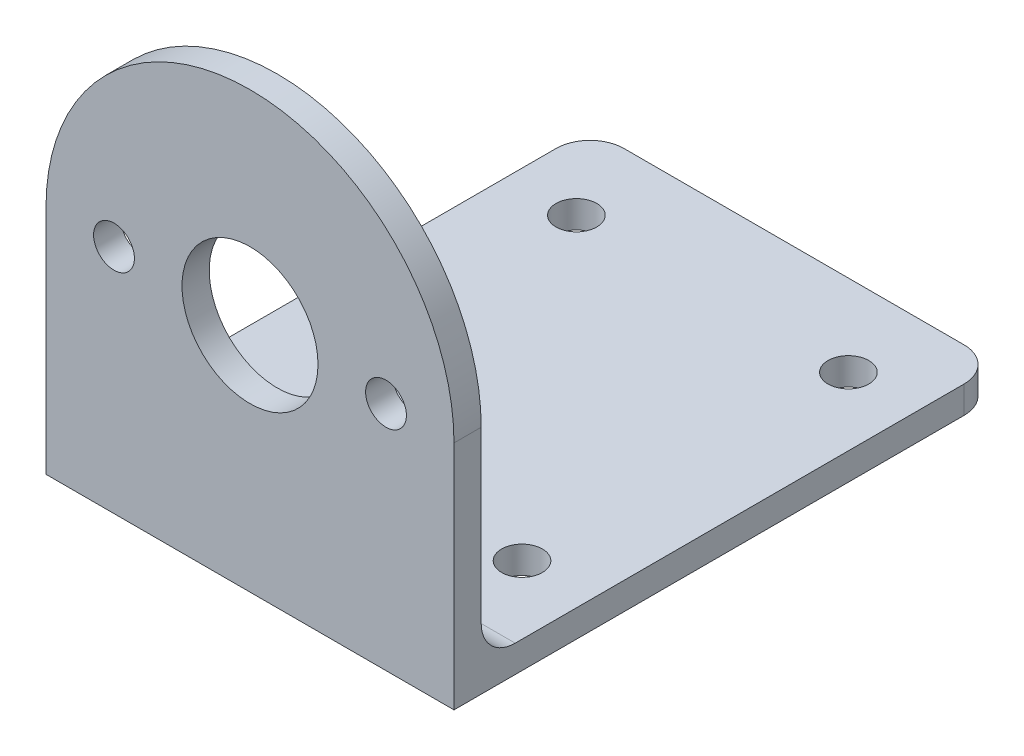
ISO-10303-21;
HEADER;
FILE_DESCRIPTION(('STEP AP214'),'2;1');
FILE_NAME('part.step','',(''),(''),'','','');
FILE_SCHEMA(('AUTOMOTIVE_DESIGN { 1 0 10303 214 1 1 1 1 }'));
ENDSEC;
DATA;
#1=APPLICATION_CONTEXT('core data for automotive mechanical design processes');
#2=APPLICATION_PROTOCOL_DEFINITION('international standard','automotive_design',2000,#1);
#3=PRODUCT_CONTEXT('',#1,'mechanical');
#4=PRODUCT('Part','Part','',(#3));
#5=PRODUCT_RELATED_PRODUCT_CATEGORY('part','',(#4));
#6=PRODUCT_DEFINITION_FORMATION('','',#4);
#7=PRODUCT_DEFINITION_CONTEXT('part definition',#1,'design');
#8=PRODUCT_DEFINITION('design','',#6,#7);
#9=PRODUCT_DEFINITION_SHAPE('','',#8);
#10=(LENGTH_UNIT() NAMED_UNIT(*) SI_UNIT(.MILLI.,.METRE.));
#11=(NAMED_UNIT(*) PLANE_ANGLE_UNIT() SI_UNIT($,.RADIAN.));
#12=(NAMED_UNIT(*) SI_UNIT($,.STERADIAN.) SOLID_ANGLE_UNIT());
#13=UNCERTAINTY_MEASURE_WITH_UNIT(LENGTH_MEASURE(1.E-05),#10,'distance_accuracy_value','');
#14=(GEOMETRIC_REPRESENTATION_CONTEXT(3) GLOBAL_UNCERTAINTY_ASSIGNED_CONTEXT((#13)) GLOBAL_UNIT_ASSIGNED_CONTEXT((#10,
#11,#12)) REPRESENTATION_CONTEXT('',''));
#15=CARTESIAN_POINT('',(0.,0.,0.));
#16=DIRECTION('',(0.,0.,1.));
#17=DIRECTION('',(1.,0.,0.));
#18=AXIS2_PLACEMENT_3D('',#15,#16,#17);
#19=CARTESIAN_POINT('',(-12.5,2.,-37.5));
#20=DIRECTION('',(0.,-1.,0.));
#21=DIRECTION('',(0.,0.,-1.));
#22=AXIS2_PLACEMENT_3D('',#19,#20,#21);
#23=PLANE('',#22);
#24=CARTESIAN_POINT('',(10.,2.,-34.));
#25=DIRECTION('',(0.,-1.,0.));
#26=DIRECTION('',(0.,0.,-1.));
#27=AXIS2_PLACEMENT_3D('',#24,#25,#26);
#28=CIRCLE('',#27,1.5);
#29=CARTESIAN_POINT('',(10.,2.,-35.5));
#30=VERTEX_POINT('',#29);
#31=EDGE_CURVE('E144',#30,#30,#28,.T.);
#32=ORIENTED_EDGE('',*,*,#31,.T.);
#33=EDGE_LOOP('',(#32));
#34=FACE_BOUND('',#33,.T.);
#35=CARTESIAN_POINT('',(-10.,2.,-34.));
#36=DIRECTION('',(0.,-1.,0.));
#37=DIRECTION('',(0.,0.,-1.));
#38=AXIS2_PLACEMENT_3D('',#35,#36,#37);
#39=CIRCLE('',#38,1.5);
#40=CARTESIAN_POINT('',(-10.,2.,-35.5));
#41=VERTEX_POINT('',#40);
#42=EDGE_CURVE('E221',#41,#41,#39,.T.);
#43=ORIENTED_EDGE('',*,*,#42,.T.);
#44=EDGE_LOOP('',(#43));
#45=FACE_BOUND('',#44,.T.);
#46=CARTESIAN_POINT('',(-10.,2.,-10.));
#47=DIRECTION('',(0.,-1.,0.));
#48=DIRECTION('',(0.,0.,-1.));
#49=AXIS2_PLACEMENT_3D('',#46,#47,#48);
#50=CIRCLE('',#49,1.5);
#51=CARTESIAN_POINT('',(-10.,2.,-11.5));
#52=VERTEX_POINT('',#51);
#53=EDGE_CURVE('E218',#52,#52,#50,.T.);
#54=ORIENTED_EDGE('',*,*,#53,.T.);
#55=EDGE_LOOP('',(#54));
#56=FACE_BOUND('',#55,.T.);
#57=CARTESIAN_POINT('',(10.,2.,-10.));
#58=DIRECTION('',(0.,-1.,0.));
#59=DIRECTION('',(0.,0.,-1.));
#60=AXIS2_PLACEMENT_3D('',#57,#58,#59);
#61=CIRCLE('',#60,1.5);
#62=CARTESIAN_POINT('',(10.,2.,-11.5));
#63=VERTEX_POINT('',#62);
#64=EDGE_CURVE('E215',#63,#63,#61,.T.);
#65=ORIENTED_EDGE('',*,*,#64,.T.);
#66=EDGE_LOOP('',(#65));
#67=FACE_BOUND('',#66,.T.);
#68=DIRECTION('',(0.,0.,1.));
#69=VECTOR('',#68,1.);
#70=CARTESIAN_POINT('',(-15.,2.,-37.5));
#71=LINE('',#70,#69);
#72=CARTESIAN_POINT('',(-15.,2.,-37.5));
#73=VERTEX_POINT('',#72);
#74=CARTESIAN_POINT('',(-15.,2.,-4.5));
#75=VERTEX_POINT('',#74);
#76=EDGE_CURVE('E157',#73,#75,#71,.T.);
#77=ORIENTED_EDGE('',*,*,#76,.T.);
#78=DIRECTION('',(-1.,0.,0.));
#79=VECTOR('',#78,1.);
#80=CARTESIAN_POINT('',(15.,2.,-4.5));
#81=LINE('',#80,#79);
#82=CARTESIAN_POINT('',(15.,2.,-4.5));
#83=VERTEX_POINT('',#82);
#84=EDGE_CURVE('E62',#75,#83,#81,.F.);
#85=ORIENTED_EDGE('',*,*,#84,.T.);
#86=DIRECTION('',(0.,0.,-1.));
#87=VECTOR('',#86,1.);
#88=CARTESIAN_POINT('',(15.,2.,-37.5));
#89=LINE('',#88,#87);
#90=CARTESIAN_POINT('',(15.,2.,-37.5));
#91=VERTEX_POINT('',#90);
#92=EDGE_CURVE('E148',#83,#91,#89,.T.);
#93=ORIENTED_EDGE('',*,*,#92,.T.);
#94=CARTESIAN_POINT('',(12.5,2.,-37.5));
#95=DIRECTION('',(0.,1.,0.));
#96=DIRECTION('',(0.,0.,1.));
#97=AXIS2_PLACEMENT_3D('',#94,#95,#96);
#98=CIRCLE('',#97,2.5);
#99=CARTESIAN_POINT('',(12.5,2.,-40.));
#100=VERTEX_POINT('',#99);
#101=EDGE_CURVE('E150',#91,#100,#98,.T.);
#102=ORIENTED_EDGE('',*,*,#101,.T.);
#103=DIRECTION('',(-1.,0.,0.));
#104=VECTOR('',#103,1.);
#105=CARTESIAN_POINT('',(-12.5,2.,-40.));
#106=LINE('',#105,#104);
#107=CARTESIAN_POINT('',(-12.5,2.,-40.));
#108=VERTEX_POINT('',#107);
#109=EDGE_CURVE('E153',#100,#108,#106,.T.);
#110=ORIENTED_EDGE('',*,*,#109,.T.);
#111=CARTESIAN_POINT('',(-12.5,2.,-37.5));
#112=DIRECTION('',(0.,1.,0.));
#113=DIRECTION('',(0.,0.,-1.));
#114=AXIS2_PLACEMENT_3D('',#111,#112,#113);
#115=CIRCLE('',#114,2.5);
#116=EDGE_CURVE('E155',#108,#73,#115,.T.);
#117=ORIENTED_EDGE('',*,*,#116,.T.);
#118=EDGE_LOOP('',(#77,#85,#93,#102,#110,#117));
#119=FACE_BOUND('',#118,.T.);
#120=ADVANCED_FACE('F39',(#34,#45,#56,#67,#119),#23,.F.);
#121=CARTESIAN_POINT('',(15.,2.,-37.5));
#122=DIRECTION('',(-1.,0.,0.));
#123=DIRECTION('',(0.,0.,1.));
#124=AXIS2_PLACEMENT_3D('',#121,#122,#123);
#125=PLANE('',#124);
#126=DIRECTION('',(0.,0.,-1.));
#127=VECTOR('',#126,1.);
#128=CARTESIAN_POINT('',(15.,0.,-37.5));
#129=LINE('',#128,#127);
#130=CARTESIAN_POINT('',(15.,0.,0.));
#131=VERTEX_POINT('',#130);
#132=CARTESIAN_POINT('',(15.,0.,-37.5));
#133=VERTEX_POINT('',#132);
#134=EDGE_CURVE('E146',#131,#133,#129,.T.);
#135=ORIENTED_EDGE('',*,*,#134,.T.);
#136=DIRECTION('',(0.,-1.,0.));
#137=VECTOR('',#136,1.);
#138=CARTESIAN_POINT('',(15.,2.,-37.5));
#139=LINE('',#138,#137);
#140=EDGE_CURVE('E183',#91,#133,#139,.T.);
#141=ORIENTED_EDGE('',*,*,#140,.F.);
#142=ORIENTED_EDGE('',*,*,#92,.F.);
#143=CARTESIAN_POINT('',(15.,4.5,-4.5));
#144=DIRECTION('',(-1.,0.,0.));
#145=DIRECTION('',(0.,0.,1.));
#146=AXIS2_PLACEMENT_3D('',#143,#144,#145);
#147=CIRCLE('',#146,2.5);
#148=CARTESIAN_POINT('',(15.,4.5,-2.));
#149=VERTEX_POINT('',#148);
#150=EDGE_CURVE('E11',#83,#149,#147,.T.);
#151=ORIENTED_EDGE('',*,*,#150,.T.);
#152=DIRECTION('',(0.,1.,0.));
#153=VECTOR('',#152,1.);
#154=CARTESIAN_POINT('',(15.,0.,-2.));
#155=LINE('',#154,#153);
#156=CARTESIAN_POINT('',(15.,17.,-2.));
#157=VERTEX_POINT('',#156);
#158=EDGE_CURVE('E111',#149,#157,#155,.T.);
#159=ORIENTED_EDGE('',*,*,#158,.T.);
#160=DIRECTION('',(0.,0.,1.));
#161=VECTOR('',#160,1.);
#162=CARTESIAN_POINT('',(15.,17.,-2.));
#163=LINE('',#162,#161);
#164=CARTESIAN_POINT('',(15.,17.,0.));
#165=VERTEX_POINT('',#164);
#166=EDGE_CURVE('E116',#157,#165,#163,.T.);
#167=ORIENTED_EDGE('',*,*,#166,.T.);
#168=DIRECTION('',(0.,-1.,0.));
#169=VECTOR('',#168,1.);
#170=CARTESIAN_POINT('',(15.,2.,0.));
#171=LINE('',#170,#169);
#172=EDGE_CURVE('E159',#165,#131,#171,.T.);
#173=ORIENTED_EDGE('',*,*,#172,.T.);
#174=EDGE_LOOP('',(#135,#141,#142,#151,#159,#167,#173));
#175=FACE_BOUND('',#174,.T.);
#176=ADVANCED_FACE('F114',(#175),#125,.F.);
#177=CARTESIAN_POINT('',(12.5,2.,-37.5));
#178=DIRECTION('',(0.,-1.,0.));
#179=DIRECTION('',(0.,0.,-1.));
#180=AXIS2_PLACEMENT_3D('',#177,#178,#179);
#181=CYLINDRICAL_SURFACE('',#180,2.5);
#182=CARTESIAN_POINT('',(12.5,0.,-37.5));
#183=DIRECTION('',(0.,1.,0.));
#184=DIRECTION('',(0.,0.,1.));
#185=AXIS2_PLACEMENT_3D('',#182,#183,#184);
#186=CIRCLE('',#185,2.5);
#187=CARTESIAN_POINT('',(12.5,0.,-40.));
#188=VERTEX_POINT('',#187);
#189=EDGE_CURVE('E161',#133,#188,#186,.T.);
#190=ORIENTED_EDGE('',*,*,#189,.T.);
#191=DIRECTION('',(0.,-1.,0.));
#192=VECTOR('',#191,1.);
#193=CARTESIAN_POINT('',(12.5,2.,-40.));
#194=LINE('',#193,#192);
#195=EDGE_CURVE('E180',#100,#188,#194,.T.);
#196=ORIENTED_EDGE('',*,*,#195,.F.);
#197=ORIENTED_EDGE('',*,*,#101,.F.);
#198=ORIENTED_EDGE('',*,*,#140,.T.);
#199=EDGE_LOOP('',(#190,#196,#197,#198));
#200=FACE_BOUND('',#199,.T.);
#201=ADVANCED_FACE('F258',(#200),#181,.T.);
#202=CARTESIAN_POINT('',(-12.5,2.,-40.));
#203=DIRECTION('',(0.,0.,1.));
#204=DIRECTION('',(1.,0.,0.));
#205=AXIS2_PLACEMENT_3D('',#202,#203,#204);
#206=PLANE('',#205);
#207=DIRECTION('',(-1.,0.,0.));
#208=VECTOR('',#207,1.);
#209=CARTESIAN_POINT('',(-12.5,0.,-40.));
#210=LINE('',#209,#208);
#211=CARTESIAN_POINT('',(-12.5,0.,-40.));
#212=VERTEX_POINT('',#211);
#213=EDGE_CURVE('E163',#188,#212,#210,.T.);
#214=ORIENTED_EDGE('',*,*,#213,.T.);
#215=DIRECTION('',(0.,-1.,0.));
#216=VECTOR('',#215,1.);
#217=CARTESIAN_POINT('',(-12.5,2.,-40.));
#218=LINE('',#217,#216);
#219=EDGE_CURVE('E177',#108,#212,#218,.T.);
#220=ORIENTED_EDGE('',*,*,#219,.F.);
#221=ORIENTED_EDGE('',*,*,#109,.F.);
#222=ORIENTED_EDGE('',*,*,#195,.T.);
#223=EDGE_LOOP('',(#214,#220,#221,#222));
#224=FACE_BOUND('',#223,.T.);
#225=ADVANCED_FACE('F350',(#224),#206,.F.);
#226=CARTESIAN_POINT('',(-12.5,2.,-37.5));
#227=DIRECTION('',(0.,-1.,0.));
#228=DIRECTION('',(0.,0.,-1.));
#229=AXIS2_PLACEMENT_3D('',#226,#227,#228);
#230=CYLINDRICAL_SURFACE('',#229,2.5);
#231=CARTESIAN_POINT('',(-12.5,0.,-37.5));
#232=DIRECTION('',(0.,1.,0.));
#233=DIRECTION('',(0.,0.,-1.));
#234=AXIS2_PLACEMENT_3D('',#231,#232,#233);
#235=CIRCLE('',#234,2.5);
#236=CARTESIAN_POINT('',(-15.,0.,-37.5));
#237=VERTEX_POINT('',#236);
#238=EDGE_CURVE('E165',#212,#237,#235,.T.);
#239=ORIENTED_EDGE('',*,*,#238,.T.);
#240=DIRECTION('',(0.,-1.,0.));
#241=VECTOR('',#240,1.);
#242=CARTESIAN_POINT('',(-15.,2.,-37.5));
#243=LINE('',#242,#241);
#244=EDGE_CURVE('E174',#73,#237,#243,.T.);
#245=ORIENTED_EDGE('',*,*,#244,.F.);
#246=ORIENTED_EDGE('',*,*,#116,.F.);
#247=ORIENTED_EDGE('',*,*,#219,.T.);
#248=EDGE_LOOP('',(#239,#245,#246,#247));
#249=FACE_BOUND('',#248,.T.);
#250=ADVANCED_FACE('F249',(#249),#230,.T.);
#251=CARTESIAN_POINT('',(-15.,2.,-37.5));
#252=DIRECTION('',(1.,0.,0.));
#253=DIRECTION('',(0.,0.,-1.));
#254=AXIS2_PLACEMENT_3D('',#251,#252,#253);
#255=PLANE('',#254);
#256=DIRECTION('',(0.,0.,1.));
#257=VECTOR('',#256,1.);
#258=CARTESIAN_POINT('',(-15.,0.,-37.5));
#259=LINE('',#258,#257);
#260=CARTESIAN_POINT('',(-15.,0.,0.));
#261=VERTEX_POINT('',#260);
#262=EDGE_CURVE('E167',#237,#261,#259,.T.);
#263=ORIENTED_EDGE('',*,*,#262,.T.);
#264=DIRECTION('',(0.,-1.,0.));
#265=VECTOR('',#264,1.);
#266=CARTESIAN_POINT('',(-15.,2.,0.));
#267=LINE('',#266,#265);
#268=CARTESIAN_POINT('',(-15.,17.,0.));
#269=VERTEX_POINT('',#268);
#270=EDGE_CURVE('E171',#269,#261,#267,.T.);
#271=ORIENTED_EDGE('',*,*,#270,.F.);
#272=DIRECTION('',(0.,0.,1.));
#273=VECTOR('',#272,1.);
#274=CARTESIAN_POINT('',(-15.,17.,-2.));
#275=LINE('',#274,#273);
#276=CARTESIAN_POINT('',(-15.,17.,-2.));
#277=VERTEX_POINT('',#276);
#278=EDGE_CURVE('E132',#277,#269,#275,.T.);
#279=ORIENTED_EDGE('',*,*,#278,.F.);
#280=DIRECTION('',(0.,1.,0.));
#281=VECTOR('',#280,1.);
#282=CARTESIAN_POINT('',(-15.,0.,-2.));
#283=LINE('',#282,#281);
#284=CARTESIAN_POINT('',(-15.,4.5,-2.));
#285=VERTEX_POINT('',#284);
#286=EDGE_CURVE('E133',#285,#277,#283,.T.);
#287=ORIENTED_EDGE('',*,*,#286,.F.);
#288=CARTESIAN_POINT('',(-15.,4.5,-4.5));
#289=DIRECTION('',(1.,0.,0.));
#290=DIRECTION('',(0.,0.,-1.));
#291=AXIS2_PLACEMENT_3D('',#288,#289,#290);
#292=CIRCLE('',#291,2.5);
#293=EDGE_CURVE('E48',#285,#75,#292,.T.);
#294=ORIENTED_EDGE('',*,*,#293,.T.);
#295=ORIENTED_EDGE('',*,*,#76,.F.);
#296=ORIENTED_EDGE('',*,*,#244,.T.);
#297=EDGE_LOOP('',(#263,#271,#279,#287,#294,#295,#296));
#298=FACE_BOUND('',#297,.T.);
#299=ADVANCED_FACE('F238',(#298),#255,.F.);
#300=CARTESIAN_POINT('',(-15.,2.,0.));
#301=DIRECTION('',(0.,0.,-1.));
#302=DIRECTION('',(-1.,0.,0.));
#303=AXIS2_PLACEMENT_3D('',#300,#301,#302);
#304=PLANE('',#303);
#305=CARTESIAN_POINT('',(10.,17.,0.));
#306=DIRECTION('',(0.,0.,1.));
#307=DIRECTION('',(1.,0.,0.));
#308=AXIS2_PLACEMENT_3D('',#305,#306,#307);
#309=CIRCLE('',#308,1.5);
#310=CARTESIAN_POINT('',(11.5,17.,0.));
#311=VERTEX_POINT('',#310);
#312=EDGE_CURVE('E191',#311,#311,#309,.T.);
#313=ORIENTED_EDGE('',*,*,#312,.F.);
#314=EDGE_LOOP('',(#313));
#315=FACE_BOUND('',#314,.T.);
#316=CARTESIAN_POINT('',(-10.,17.,0.));
#317=DIRECTION('',(0.,0.,1.));
#318=DIRECTION('',(-1.,0.,0.));
#319=AXIS2_PLACEMENT_3D('',#316,#317,#318);
#320=CIRCLE('',#319,1.5);
#321=CARTESIAN_POINT('',(-11.5,17.,0.));
#322=VERTEX_POINT('',#321);
#323=EDGE_CURVE('E197',#322,#322,#320,.T.);
#324=ORIENTED_EDGE('',*,*,#323,.F.);
#325=EDGE_LOOP('',(#324));
#326=FACE_BOUND('',#325,.T.);
#327=DIRECTION('',(1.,0.,0.));
#328=VECTOR('',#327,1.);
#329=CARTESIAN_POINT('',(-15.,0.,0.));
#330=LINE('',#329,#328);
#331=EDGE_CURVE('E151',#261,#131,#330,.T.);
#332=ORIENTED_EDGE('',*,*,#331,.T.);
#333=ORIENTED_EDGE('',*,*,#172,.F.);
#334=CARTESIAN_POINT('',(0.,17.,0.));
#335=DIRECTION('',(0.,0.,1.));
#336=DIRECTION('',(1.,0.,0.));
#337=AXIS2_PLACEMENT_3D('',#334,#335,#336);
#338=CIRCLE('',#337,15.);
#339=EDGE_CURVE('E131',#165,#269,#338,.T.);
#340=ORIENTED_EDGE('',*,*,#339,.T.);
#341=ORIENTED_EDGE('',*,*,#270,.T.);
#342=EDGE_LOOP('',(#332,#333,#340,#341));
#343=FACE_BOUND('',#342,.T.);
#344=CARTESIAN_POINT('',(0.,17.,0.));
#345=DIRECTION('',(0.,0.,1.));
#346=DIRECTION('',(1.,0.,0.));
#347=AXIS2_PLACEMENT_3D('',#344,#345,#346);
#348=CIRCLE('',#347,5.);
#349=CARTESIAN_POINT('',(5.,17.,0.));
#350=VERTEX_POINT('',#349);
#351=EDGE_CURVE('E141',#350,#350,#348,.T.);
#352=ORIENTED_EDGE('',*,*,#351,.F.);
#353=EDGE_LOOP('',(#352));
#354=FACE_BOUND('',#353,.T.);
#355=ADVANCED_FACE('F236',(#315,#326,#343,#354),#304,.F.);
#356=CARTESIAN_POINT('',(-12.5,0.,-37.5));
#357=DIRECTION('',(0.,-1.,0.));
#358=DIRECTION('',(0.,0.,-1.));
#359=AXIS2_PLACEMENT_3D('',#356,#357,#358);
#360=PLANE('',#359);
#361=CARTESIAN_POINT('',(10.,0.,-34.));
#362=DIRECTION('',(0.,-1.,0.));
#363=DIRECTION('',(0.,0.,-1.));
#364=AXIS2_PLACEMENT_3D('',#361,#362,#363);
#365=CIRCLE('',#364,1.5);
#366=CARTESIAN_POINT('',(10.,0.,-35.5));
#367=VERTEX_POINT('',#366);
#368=EDGE_CURVE('E195',#367,#367,#365,.T.);
#369=ORIENTED_EDGE('',*,*,#368,.F.);
#370=EDGE_LOOP('',(#369));
#371=FACE_BOUND('',#370,.T.);
#372=CARTESIAN_POINT('',(-10.,0.,-34.));
#373=DIRECTION('',(0.,-1.,0.));
#374=DIRECTION('',(0.,0.,-1.));
#375=AXIS2_PLACEMENT_3D('',#372,#373,#374);
#376=CIRCLE('',#375,1.5);
#377=CARTESIAN_POINT('',(-10.,0.,-35.5));
#378=VERTEX_POINT('',#377);
#379=EDGE_CURVE('E208',#378,#378,#376,.T.);
#380=ORIENTED_EDGE('',*,*,#379,.F.);
#381=EDGE_LOOP('',(#380));
#382=FACE_BOUND('',#381,.T.);
#383=CARTESIAN_POINT('',(-10.,0.,-10.));
#384=DIRECTION('',(0.,-1.,0.));
#385=DIRECTION('',(0.,0.,-1.));
#386=AXIS2_PLACEMENT_3D('',#383,#384,#385);
#387=CIRCLE('',#386,1.5);
#388=CARTESIAN_POINT('',(-10.,0.,-11.5));
#389=VERTEX_POINT('',#388);
#390=EDGE_CURVE('E204',#389,#389,#387,.T.);
#391=ORIENTED_EDGE('',*,*,#390,.F.);
#392=EDGE_LOOP('',(#391));
#393=FACE_BOUND('',#392,.T.);
#394=CARTESIAN_POINT('',(10.,0.,-10.));
#395=DIRECTION('',(0.,-1.,0.));
#396=DIRECTION('',(0.,0.,-1.));
#397=AXIS2_PLACEMENT_3D('',#394,#395,#396);
#398=CIRCLE('',#397,1.5);
#399=CARTESIAN_POINT('',(10.,0.,-11.5));
#400=VERTEX_POINT('',#399);
#401=EDGE_CURVE('E207',#400,#400,#398,.T.);
#402=ORIENTED_EDGE('',*,*,#401,.F.);
#403=EDGE_LOOP('',(#402));
#404=FACE_BOUND('',#403,.T.);
#405=ORIENTED_EDGE('',*,*,#134,.F.);
#406=ORIENTED_EDGE('',*,*,#331,.F.);
#407=ORIENTED_EDGE('',*,*,#262,.F.);
#408=ORIENTED_EDGE('',*,*,#238,.F.);
#409=ORIENTED_EDGE('',*,*,#213,.F.);
#410=ORIENTED_EDGE('',*,*,#189,.F.);
#411=EDGE_LOOP('',(#405,#406,#407,#408,#409,#410));
#412=FACE_BOUND('',#411,.T.);
#413=ADVANCED_FACE('F232',(#371,#382,#393,#404,#412),#360,.T.);
#414=CARTESIAN_POINT('',(0.,17.,-2.));
#415=DIRECTION('',(0.,0.,1.));
#416=DIRECTION('',(1.,0.,0.));
#417=AXIS2_PLACEMENT_3D('',#414,#415,#416);
#418=CYLINDRICAL_SURFACE('',#417,5.);
#419=CARTESIAN_POINT('',(0.,17.,-2.));
#420=DIRECTION('',(0.,0.,1.));
#421=DIRECTION('',(1.,0.,0.));
#422=AXIS2_PLACEMENT_3D('',#419,#420,#421);
#423=CIRCLE('',#422,5.);
#424=CARTESIAN_POINT('',(5.,17.,-2.));
#425=VERTEX_POINT('',#424);
#426=EDGE_CURVE('E124',#425,#425,#423,.T.);
#427=ORIENTED_EDGE('',*,*,#426,.F.);
#428=EDGE_LOOP('',(#427));
#429=FACE_BOUND('',#428,.T.);
#430=ORIENTED_EDGE('',*,*,#351,.T.);
#431=EDGE_LOOP('',(#430));
#432=FACE_BOUND('',#431,.T.);
#433=ADVANCED_FACE('F229',(#429,#432),#418,.F.);
#434=CARTESIAN_POINT('',(0.,17.,-2.));
#435=DIRECTION('',(0.,0.,1.));
#436=DIRECTION('',(1.,0.,0.));
#437=AXIS2_PLACEMENT_3D('',#434,#435,#436);
#438=CYLINDRICAL_SURFACE('',#437,15.);
#439=ORIENTED_EDGE('',*,*,#339,.F.);
#440=ORIENTED_EDGE('',*,*,#166,.F.);
#441=CARTESIAN_POINT('',(0.,17.,-2.));
#442=DIRECTION('',(0.,0.,1.));
#443=DIRECTION('',(1.,0.,0.));
#444=AXIS2_PLACEMENT_3D('',#441,#442,#443);
#445=CIRCLE('',#444,15.);
#446=EDGE_CURVE('E123',#157,#277,#445,.T.);
#447=ORIENTED_EDGE('',*,*,#446,.T.);
#448=ORIENTED_EDGE('',*,*,#278,.T.);
#449=EDGE_LOOP('',(#439,#440,#447,#448));
#450=FACE_BOUND('',#449,.T.);
#451=ADVANCED_FACE('F128',(#450),#438,.T.);
#452=CARTESIAN_POINT('',(0.,0.,-2.));
#453=DIRECTION('',(0.,0.,1.));
#454=DIRECTION('',(1.,0.,0.));
#455=AXIS2_PLACEMENT_3D('',#452,#453,#454);
#456=PLANE('',#455);
#457=CARTESIAN_POINT('',(10.,17.,-2.));
#458=DIRECTION('',(0.,0.,1.));
#459=DIRECTION('',(1.,0.,0.));
#460=AXIS2_PLACEMENT_3D('',#457,#458,#459);
#461=CIRCLE('',#460,1.5);
#462=CARTESIAN_POINT('',(11.5,17.,-2.));
#463=VERTEX_POINT('',#462);
#464=EDGE_CURVE('E43',#463,#463,#461,.T.);
#465=ORIENTED_EDGE('',*,*,#464,.T.);
#466=EDGE_LOOP('',(#465));
#467=FACE_BOUND('',#466,.T.);
#468=CARTESIAN_POINT('',(-10.,17.,-2.));
#469=DIRECTION('',(0.,0.,1.));
#470=DIRECTION('',(1.,0.,0.));
#471=AXIS2_PLACEMENT_3D('',#468,#469,#470);
#472=CIRCLE('',#471,1.5);
#473=CARTESIAN_POINT('',(-8.5,17.,-2.));
#474=VERTEX_POINT('',#473);
#475=EDGE_CURVE('E189',#474,#474,#472,.T.);
#476=ORIENTED_EDGE('',*,*,#475,.T.);
#477=EDGE_LOOP('',(#476));
#478=FACE_BOUND('',#477,.T.);
#479=ORIENTED_EDGE('',*,*,#426,.T.);
#480=EDGE_LOOP('',(#479));
#481=FACE_BOUND('',#480,.T.);
#482=ORIENTED_EDGE('',*,*,#158,.F.);
#483=DIRECTION('',(-1.,0.,0.));
#484=VECTOR('',#483,1.);
#485=CARTESIAN_POINT('',(-15.,4.5,-2.));
#486=LINE('',#485,#484);
#487=EDGE_CURVE('E186',#149,#285,#486,.T.);
#488=ORIENTED_EDGE('',*,*,#487,.T.);
#489=ORIENTED_EDGE('',*,*,#286,.T.);
#490=ORIENTED_EDGE('',*,*,#446,.F.);
#491=EDGE_LOOP('',(#482,#488,#489,#490));
#492=FACE_BOUND('',#491,.T.);
#493=ADVANCED_FACE('F135',(#467,#478,#481,#492),#456,.F.);
#494=CARTESIAN_POINT('',(0.,4.5,-4.5));
#495=DIRECTION('',(1.,0.,0.));
#496=DIRECTION('',(0.,0.,-1.));
#497=AXIS2_PLACEMENT_3D('',#494,#495,#496);
#498=CYLINDRICAL_SURFACE('',#497,2.5);
#499=ORIENTED_EDGE('',*,*,#150,.F.);
#500=ORIENTED_EDGE('',*,*,#84,.F.);
#501=ORIENTED_EDGE('',*,*,#293,.F.);
#502=ORIENTED_EDGE('',*,*,#487,.F.);
#503=EDGE_LOOP('',(#499,#500,#501,#502));
#504=FACE_BOUND('',#503,.T.);
#505=ADVANCED_FACE('F41',(#504),#498,.F.);
#506=CARTESIAN_POINT('',(10.,12.,-10.));
#507=DIRECTION('',(0.,-1.,0.));
#508=DIRECTION('',(0.,0.,-1.));
#509=AXIS2_PLACEMENT_3D('',#506,#507,#508);
#510=CYLINDRICAL_SURFACE('',#509,1.5);
#511=ORIENTED_EDGE('',*,*,#401,.T.);
#512=EDGE_LOOP('',(#511));
#513=FACE_BOUND('',#512,.T.);
#514=ORIENTED_EDGE('',*,*,#64,.F.);
#515=EDGE_LOOP('',(#514));
#516=FACE_BOUND('',#515,.T.);
#517=ADVANCED_FACE('F265',(#513,#516),#510,.F.);
#518=CARTESIAN_POINT('',(-10.,12.,-10.));
#519=DIRECTION('',(0.,-1.,0.));
#520=DIRECTION('',(0.,0.,-1.));
#521=AXIS2_PLACEMENT_3D('',#518,#519,#520);
#522=CYLINDRICAL_SURFACE('',#521,1.5);
#523=ORIENTED_EDGE('',*,*,#390,.T.);
#524=EDGE_LOOP('',(#523));
#525=FACE_BOUND('',#524,.T.);
#526=ORIENTED_EDGE('',*,*,#53,.F.);
#527=EDGE_LOOP('',(#526));
#528=FACE_BOUND('',#527,.T.);
#529=ADVANCED_FACE('F268',(#525,#528),#522,.F.);
#530=CARTESIAN_POINT('',(-10.,12.,-34.));
#531=DIRECTION('',(0.,-1.,0.));
#532=DIRECTION('',(0.,0.,-1.));
#533=AXIS2_PLACEMENT_3D('',#530,#531,#532);
#534=CYLINDRICAL_SURFACE('',#533,1.5);
#535=ORIENTED_EDGE('',*,*,#379,.T.);
#536=EDGE_LOOP('',(#535));
#537=FACE_BOUND('',#536,.T.);
#538=ORIENTED_EDGE('',*,*,#42,.F.);
#539=EDGE_LOOP('',(#538));
#540=FACE_BOUND('',#539,.T.);
#541=ADVANCED_FACE('F274',(#537,#540),#534,.F.);
#542=CARTESIAN_POINT('',(10.,12.,-34.));
#543=DIRECTION('',(0.,-1.,0.));
#544=DIRECTION('',(0.,0.,-1.));
#545=AXIS2_PLACEMENT_3D('',#542,#543,#544);
#546=CYLINDRICAL_SURFACE('',#545,1.5);
#547=ORIENTED_EDGE('',*,*,#368,.T.);
#548=EDGE_LOOP('',(#547));
#549=FACE_BOUND('',#548,.T.);
#550=ORIENTED_EDGE('',*,*,#31,.F.);
#551=EDGE_LOOP('',(#550));
#552=FACE_BOUND('',#551,.T.);
#553=ADVANCED_FACE('F270',(#549,#552),#546,.F.);
#554=CARTESIAN_POINT('',(-10.,17.,-10.));
#555=DIRECTION('',(0.,0.,1.));
#556=DIRECTION('',(1.,0.,0.));
#557=AXIS2_PLACEMENT_3D('',#554,#555,#556);
#558=CYLINDRICAL_SURFACE('',#557,1.5);
#559=ORIENTED_EDGE('',*,*,#323,.T.);
#560=EDGE_LOOP('',(#559));
#561=FACE_BOUND('',#560,.T.);
#562=ORIENTED_EDGE('',*,*,#475,.F.);
#563=EDGE_LOOP('',(#562));
#564=FACE_BOUND('',#563,.T.);
#565=ADVANCED_FACE('F273',(#561,#564),#558,.F.);
#566=CARTESIAN_POINT('',(10.,17.,-10.));
#567=DIRECTION('',(0.,0.,1.));
#568=DIRECTION('',(1.,0.,0.));
#569=AXIS2_PLACEMENT_3D('',#566,#567,#568);
#570=CYLINDRICAL_SURFACE('',#569,1.5);
#571=ORIENTED_EDGE('',*,*,#312,.T.);
#572=EDGE_LOOP('',(#571));
#573=FACE_BOUND('',#572,.T.);
#574=ORIENTED_EDGE('',*,*,#464,.F.);
#575=EDGE_LOOP('',(#574));
#576=FACE_BOUND('',#575,.T.);
#577=ADVANCED_FACE('F284',(#573,#576),#570,.F.);
#578=CLOSED_SHELL('',(#120,#176,#201,#225,#250,#299,#355,#413,#433,#451,#493,#505,#517,#529,
#541,#553,#565,#577));
#579=MANIFOLD_SOLID_BREP('B2',#578);
#580=ADVANCED_BREP_SHAPE_REPRESENTATION('',(#18,#579),#14);
#581=SHAPE_DEFINITION_REPRESENTATION(#9,#580);
ENDSEC;
END-ISO-10303-21;
